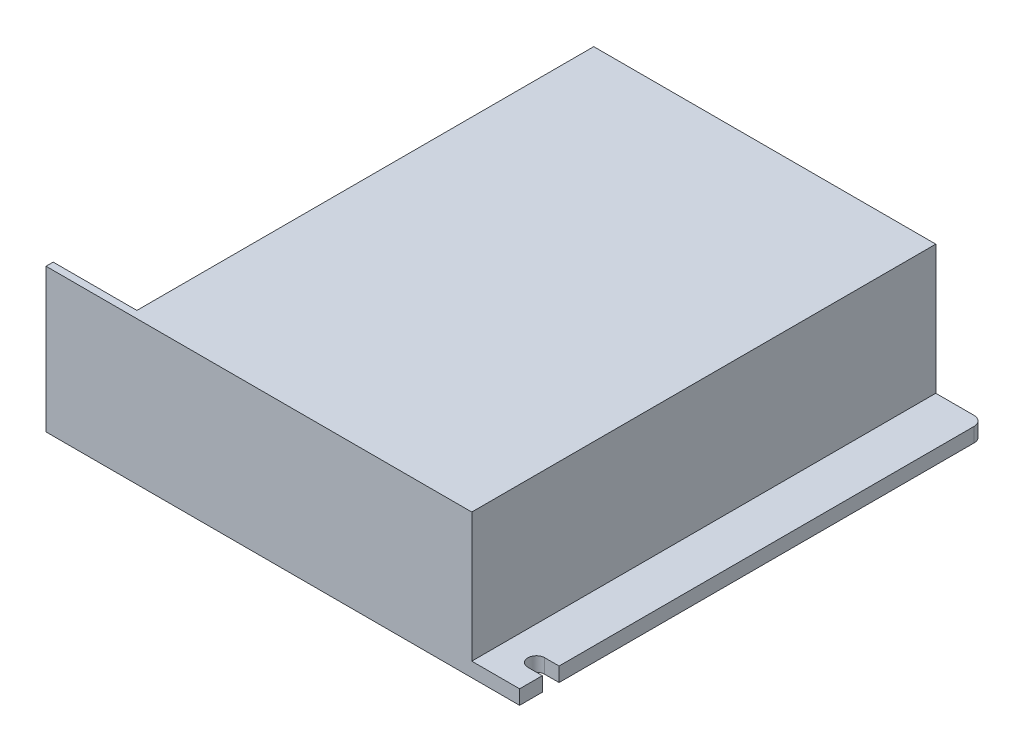
ISO-10303-21;
HEADER;
FILE_DESCRIPTION(('STEP AP214'),'2;1');
FILE_NAME('part.step','',(''),(''),'','','');
FILE_SCHEMA(('AUTOMOTIVE_DESIGN { 1 0 10303 214 1 1 1 1 }'));
ENDSEC;
DATA;
#1=APPLICATION_CONTEXT('core data for automotive mechanical design processes');
#2=APPLICATION_PROTOCOL_DEFINITION('international standard','automotive_design',2000,#1);
#3=PRODUCT_CONTEXT('',#1,'mechanical');
#4=PRODUCT('Part','Part','',(#3));
#5=PRODUCT_RELATED_PRODUCT_CATEGORY('part','',(#4));
#6=PRODUCT_DEFINITION_FORMATION('','',#4);
#7=PRODUCT_DEFINITION_CONTEXT('part definition',#1,'design');
#8=PRODUCT_DEFINITION('design','',#6,#7);
#9=PRODUCT_DEFINITION_SHAPE('','',#8);
#10=(LENGTH_UNIT() NAMED_UNIT(*) SI_UNIT(.MILLI.,.METRE.));
#11=(NAMED_UNIT(*) PLANE_ANGLE_UNIT() SI_UNIT($,.RADIAN.));
#12=(NAMED_UNIT(*) SI_UNIT($,.STERADIAN.) SOLID_ANGLE_UNIT());
#13=UNCERTAINTY_MEASURE_WITH_UNIT(LENGTH_MEASURE(1.E-05),#10,'distance_accuracy_value','');
#14=(GEOMETRIC_REPRESENTATION_CONTEXT(3) GLOBAL_UNCERTAINTY_ASSIGNED_CONTEXT((#13)) GLOBAL_UNIT_ASSIGNED_CONTEXT((#10,
#11,#12)) REPRESENTATION_CONTEXT('',''));
#15=CARTESIAN_POINT('',(0.,0.,0.));
#16=DIRECTION('',(0.,0.,1.));
#17=DIRECTION('',(1.,0.,0.));
#18=AXIS2_PLACEMENT_3D('',#15,#16,#17);
#19=CARTESIAN_POINT('',(99.,3.,0.));
#20=DIRECTION('',(-1.,0.,0.));
#21=DIRECTION('',(0.,0.,1.));
#22=AXIS2_PLACEMENT_3D('',#19,#20,#21);
#23=PLANE('',#22);
#24=DIRECTION('',(0.,0.,-1.));
#25=VECTOR('',#24,1.);
#26=CARTESIAN_POINT('',(99.,0.,0.));
#27=LINE('',#26,#25);
#28=CARTESIAN_POINT('',(99.,0.,-8.25));
#29=VERTEX_POINT('',#28);
#30=CARTESIAN_POINT('',(99.,0.,-95.));
#31=VERTEX_POINT('',#30);
#32=EDGE_CURVE('E275',#29,#31,#27,.T.);
#33=ORIENTED_EDGE('',*,*,#32,.T.);
#34=DIRECTION('',(0.,-1.,0.));
#35=VECTOR('',#34,1.);
#36=CARTESIAN_POINT('',(99.,3.,-95.));
#37=LINE('',#36,#35);
#38=CARTESIAN_POINT('',(99.,3.,-95.));
#39=VERTEX_POINT('',#38);
#40=EDGE_CURVE('E61',#31,#39,#37,.F.);
#41=ORIENTED_EDGE('',*,*,#40,.T.);
#42=DIRECTION('',(0.,0.,-1.));
#43=VECTOR('',#42,1.);
#44=CARTESIAN_POINT('',(99.,3.,0.));
#45=LINE('',#44,#43);
#46=CARTESIAN_POINT('',(99.,3.,-8.25));
#47=VERTEX_POINT('',#46);
#48=EDGE_CURVE('E260',#47,#39,#45,.T.);
#49=ORIENTED_EDGE('',*,*,#48,.F.);
#50=DIRECTION('',(0.,1.,0.));
#51=VECTOR('',#50,1.);
#52=CARTESIAN_POINT('',(99.,0.,-8.25));
#53=LINE('',#52,#51);
#54=EDGE_CURVE('E194',#29,#47,#53,.T.);
#55=ORIENTED_EDGE('',*,*,#54,.F.);
#56=EDGE_LOOP('',(#33,#41,#49,#55));
#57=FACE_BOUND('',#56,.T.);
#58=ADVANCED_FACE('F39',(#57),#23,.F.);
#59=CARTESIAN_POINT('',(0.,3.,0.));
#60=DIRECTION('',(0.,-1.,0.));
#61=DIRECTION('',(0.,0.,-1.));
#62=AXIS2_PLACEMENT_3D('',#59,#60,#61);
#63=PLANE('',#62);
#64=ORIENTED_EDGE('',*,*,#48,.T.);
#65=CARTESIAN_POINT('',(97.,3.,-95.));
#66=DIRECTION('',(0.,-1.,0.));
#67=DIRECTION('',(0.,0.,-1.));
#68=AXIS2_PLACEMENT_3D('',#65,#66,#67);
#69=CIRCLE('',#68,2.);
#70=CARTESIAN_POINT('',(97.,3.,-97.));
#71=VERTEX_POINT('',#70);
#72=EDGE_CURVE('E304',#39,#71,#69,.F.);
#73=ORIENTED_EDGE('',*,*,#72,.T.);
#74=DIRECTION('',(-1.,0.,0.));
#75=VECTOR('',#74,1.);
#76=CARTESIAN_POINT('',(0.,3.,-97.));
#77=LINE('',#76,#75);
#78=CARTESIAN_POINT('',(89.,3.,-97.));
#79=VERTEX_POINT('',#78);
#80=EDGE_CURVE('E266',#71,#79,#77,.T.);
#81=ORIENTED_EDGE('',*,*,#80,.T.);
#82=DIRECTION('',(0.,0.,-1.));
#83=VECTOR('',#82,1.);
#84=CARTESIAN_POINT('',(89.,3.,-97.));
#85=LINE('',#84,#83);
#86=CARTESIAN_POINT('',(89.,3.,0.));
#87=VERTEX_POINT('',#86);
#88=EDGE_CURVE('E204',#87,#79,#85,.T.);
#89=ORIENTED_EDGE('',*,*,#88,.F.);
#90=DIRECTION('',(1.,0.,0.));
#91=VECTOR('',#90,1.);
#92=CARTESIAN_POINT('',(0.,3.,0.));
#93=LINE('',#92,#91);
#94=CARTESIAN_POINT('',(99.,3.,0.));
#95=VERTEX_POINT('',#94);
#96=EDGE_CURVE('E256',#87,#95,#93,.T.);
#97=ORIENTED_EDGE('',*,*,#96,.T.);
#98=CARTESIAN_POINT('',(99.,3.,-4.75));
#99=VERTEX_POINT('',#98);
#100=EDGE_CURVE('E261',#95,#99,#45,.T.);
#101=ORIENTED_EDGE('',*,*,#100,.T.);
#102=DIRECTION('',(1.,0.,0.));
#103=VECTOR('',#102,1.);
#104=CARTESIAN_POINT('',(99.,3.,-4.75));
#105=LINE('',#104,#103);
#106=CARTESIAN_POINT('',(96.,3.,-4.75));
#107=VERTEX_POINT('',#106);
#108=EDGE_CURVE('E179',#107,#99,#105,.T.);
#109=ORIENTED_EDGE('',*,*,#108,.F.);
#110=CARTESIAN_POINT('',(96.,3.,-6.5));
#111=DIRECTION('',(0.,1.,0.));
#112=DIRECTION('',(0.,0.,-1.));
#113=AXIS2_PLACEMENT_3D('',#110,#111,#112);
#114=CIRCLE('',#113,1.75);
#115=CARTESIAN_POINT('',(96.,3.,-8.25));
#116=VERTEX_POINT('',#115);
#117=EDGE_CURVE('E155',#116,#107,#114,.T.);
#118=ORIENTED_EDGE('',*,*,#117,.F.);
#119=DIRECTION('',(-1.,0.,0.));
#120=VECTOR('',#119,1.);
#121=CARTESIAN_POINT('',(96.,3.,-8.25));
#122=LINE('',#121,#120);
#123=EDGE_CURVE('E175',#47,#116,#122,.T.);
#124=ORIENTED_EDGE('',*,*,#123,.F.);
#125=EDGE_LOOP('',(#64,#73,#81,#89,#97,#101,#109,#118,#124));
#126=FACE_BOUND('',#125,.T.);
#127=ADVANCED_FACE('F350',(#126),#63,.F.);
#128=CARTESIAN_POINT('',(3.5,3.,-91.5));
#129=DIRECTION('',(0.,1.,0.));
#130=DIRECTION('',(0.,0.,1.));
#131=AXIS2_PLACEMENT_3D('',#128,#129,#130);
#132=CIRCLE('',#131,1.75);
#133=CARTESIAN_POINT('',(3.5,3.,-89.75));
#134=VERTEX_POINT('',#133);
#135=EDGE_CURVE('E182',#134,#134,#132,.T.);
#136=ORIENTED_EDGE('',*,*,#135,.F.);
#137=EDGE_LOOP('',(#136));
#138=FACE_BOUND('',#137,.T.);
#139=CARTESIAN_POINT('',(17.5,3.,-97.));
#140=VERTEX_POINT('',#139);
#141=CARTESIAN_POINT('',(2.,3.,-97.));
#142=VERTEX_POINT('',#141);
#143=EDGE_CURVE('E265',#140,#142,#77,.T.);
#144=ORIENTED_EDGE('',*,*,#143,.T.);
#145=CARTESIAN_POINT('',(2.,3.,-95.));
#146=DIRECTION('',(0.,-1.,0.));
#147=DIRECTION('',(0.,0.,-1.));
#148=AXIS2_PLACEMENT_3D('',#145,#146,#147);
#149=CIRCLE('',#148,2.);
#150=CARTESIAN_POINT('',(0.,3.,-95.));
#151=VERTEX_POINT('',#150);
#152=EDGE_CURVE('E11',#142,#151,#149,.F.);
#153=ORIENTED_EDGE('',*,*,#152,.T.);
#154=DIRECTION('',(0.,0.,1.));
#155=VECTOR('',#154,1.);
#156=CARTESIAN_POINT('',(0.,3.,0.));
#157=LINE('',#156,#155);
#158=CARTESIAN_POINT('',(0.,3.,-1.5));
#159=VERTEX_POINT('',#158);
#160=EDGE_CURVE('E253',#151,#159,#157,.T.);
#161=ORIENTED_EDGE('',*,*,#160,.T.);
#162=DIRECTION('',(-1.,0.,0.));
#163=VECTOR('',#162,1.);
#164=CARTESIAN_POINT('',(17.5,3.,-1.5));
#165=LINE('',#164,#163);
#166=CARTESIAN_POINT('',(17.5,3.,-1.5));
#167=VERTEX_POINT('',#166);
#168=EDGE_CURVE('E225',#167,#159,#165,.T.);
#169=ORIENTED_EDGE('',*,*,#168,.F.);
#170=DIRECTION('',(0.,0.,1.));
#171=VECTOR('',#170,1.);
#172=CARTESIAN_POINT('',(17.5,3.,-97.));
#173=LINE('',#172,#171);
#174=EDGE_CURVE('E221',#140,#167,#173,.T.);
#175=ORIENTED_EDGE('',*,*,#174,.F.);
#176=EDGE_LOOP('',(#144,#153,#161,#169,#175));
#177=FACE_BOUND('',#176,.T.);
#178=ADVANCED_FACE('F327',(#138,#177),#63,.F.);
#179=CARTESIAN_POINT('',(0.,3.,0.));
#180=DIRECTION('',(1.,0.,0.));
#181=DIRECTION('',(0.,0.,-1.));
#182=AXIS2_PLACEMENT_3D('',#179,#180,#181);
#183=PLANE('',#182);
#184=ORIENTED_EDGE('',*,*,#160,.F.);
#185=DIRECTION('',(0.,-1.,0.));
#186=VECTOR('',#185,1.);
#187=CARTESIAN_POINT('',(0.,3.,-95.));
#188=LINE('',#187,#186);
#189=CARTESIAN_POINT('',(0.,0.,-95.));
#190=VERTEX_POINT('',#189);
#191=EDGE_CURVE('E48',#151,#190,#188,.T.);
#192=ORIENTED_EDGE('',*,*,#191,.T.);
#193=DIRECTION('',(0.,0.,1.));
#194=VECTOR('',#193,1.);
#195=CARTESIAN_POINT('',(0.,0.,0.));
#196=LINE('',#195,#194);
#197=CARTESIAN_POINT('',(0.,0.,0.));
#198=VERTEX_POINT('',#197);
#199=EDGE_CURVE('E252',#190,#198,#196,.T.);
#200=ORIENTED_EDGE('',*,*,#199,.T.);
#201=DIRECTION('',(0.,-1.,0.));
#202=VECTOR('',#201,1.);
#203=CARTESIAN_POINT('',(0.,3.,0.));
#204=LINE('',#203,#202);
#205=CARTESIAN_POINT('',(0.,30.,0.));
#206=VERTEX_POINT('',#205);
#207=EDGE_CURVE('E285',#206,#198,#204,.T.);
#208=ORIENTED_EDGE('',*,*,#207,.F.);
#209=DIRECTION('',(0.,0.,1.));
#210=VECTOR('',#209,1.);
#211=CARTESIAN_POINT('',(0.,30.,-1.5));
#212=LINE('',#211,#210);
#213=CARTESIAN_POINT('',(0.,30.,-1.5));
#214=VERTEX_POINT('',#213);
#215=EDGE_CURVE('E207',#214,#206,#212,.T.);
#216=ORIENTED_EDGE('',*,*,#215,.F.);
#217=DIRECTION('',(0.,-1.,0.));
#218=VECTOR('',#217,1.);
#219=CARTESIAN_POINT('',(0.,30.,-1.5));
#220=LINE('',#219,#218);
#221=EDGE_CURVE('E244',#214,#159,#220,.T.);
#222=ORIENTED_EDGE('',*,*,#221,.T.);
#223=EDGE_LOOP('',(#184,#192,#200,#208,#216,#222));
#224=FACE_BOUND('',#223,.T.);
#225=ADVANCED_FACE('F311',(#224),#183,.F.);
#226=CARTESIAN_POINT('',(0.,3.,0.));
#227=DIRECTION('',(0.,0.,-1.));
#228=DIRECTION('',(-1.,0.,0.));
#229=AXIS2_PLACEMENT_3D('',#226,#227,#228);
#230=PLANE('',#229);
#231=DIRECTION('',(1.,0.,0.));
#232=VECTOR('',#231,1.);
#233=CARTESIAN_POINT('',(0.,0.,0.));
#234=LINE('',#233,#232);
#235=CARTESIAN_POINT('',(99.,0.,0.));
#236=VERTEX_POINT('',#235);
#237=EDGE_CURVE('E272',#198,#236,#234,.T.);
#238=ORIENTED_EDGE('',*,*,#237,.T.);
#239=DIRECTION('',(0.,-1.,0.));
#240=VECTOR('',#239,1.);
#241=CARTESIAN_POINT('',(99.,3.,0.));
#242=LINE('',#241,#240);
#243=EDGE_CURVE('E269',#95,#236,#242,.T.);
#244=ORIENTED_EDGE('',*,*,#243,.F.);
#245=ORIENTED_EDGE('',*,*,#96,.F.);
#246=DIRECTION('',(0.,-1.,0.));
#247=VECTOR('',#246,1.);
#248=CARTESIAN_POINT('',(89.,30.,0.));
#249=LINE('',#248,#247);
#250=CARTESIAN_POINT('',(89.,30.,0.));
#251=VERTEX_POINT('',#250);
#252=EDGE_CURVE('E240',#251,#87,#249,.T.);
#253=ORIENTED_EDGE('',*,*,#252,.F.);
#254=DIRECTION('',(1.,0.,0.));
#255=VECTOR('',#254,1.);
#256=CARTESIAN_POINT('',(0.,30.,0.));
#257=LINE('',#256,#255);
#258=EDGE_CURVE('E211',#206,#251,#257,.T.);
#259=ORIENTED_EDGE('',*,*,#258,.F.);
#260=ORIENTED_EDGE('',*,*,#207,.T.);
#261=EDGE_LOOP('',(#238,#244,#245,#253,#259,#260));
#262=FACE_BOUND('',#261,.T.);
#263=ADVANCED_FACE('F317',(#262),#230,.F.);
#264=CARTESIAN_POINT('',(99.,0.,-4.75));
#265=VERTEX_POINT('',#264);
#266=EDGE_CURVE('E276',#236,#265,#27,.T.);
#267=ORIENTED_EDGE('',*,*,#266,.T.);
#268=DIRECTION('',(0.,1.,0.));
#269=VECTOR('',#268,1.);
#270=CARTESIAN_POINT('',(99.,0.,-4.75));
#271=LINE('',#270,#269);
#272=EDGE_CURVE('E159',#265,#99,#271,.T.);
#273=ORIENTED_EDGE('',*,*,#272,.T.);
#274=ORIENTED_EDGE('',*,*,#100,.F.);
#275=ORIENTED_EDGE('',*,*,#243,.T.);
#276=EDGE_LOOP('',(#267,#273,#274,#275));
#277=FACE_BOUND('',#276,.T.);
#278=ADVANCED_FACE('F352',(#277),#23,.F.);
#279=CARTESIAN_POINT('',(0.,3.,-97.));
#280=DIRECTION('',(0.,0.,1.));
#281=DIRECTION('',(1.,0.,0.));
#282=AXIS2_PLACEMENT_3D('',#279,#280,#281);
#283=PLANE('',#282);
#284=ORIENTED_EDGE('',*,*,#80,.F.);
#285=DIRECTION('',(0.,-1.,0.));
#286=VECTOR('',#285,1.);
#287=CARTESIAN_POINT('',(97.,3.,-97.));
#288=LINE('',#287,#286);
#289=CARTESIAN_POINT('',(97.,0.,-97.));
#290=VERTEX_POINT('',#289);
#291=EDGE_CURVE('E292',#71,#290,#288,.T.);
#292=ORIENTED_EDGE('',*,*,#291,.T.);
#293=DIRECTION('',(-1.,0.,0.));
#294=VECTOR('',#293,1.);
#295=CARTESIAN_POINT('',(0.,0.,-97.));
#296=LINE('',#295,#294);
#297=CARTESIAN_POINT('',(2.,0.,-97.));
#298=VERTEX_POINT('',#297);
#299=EDGE_CURVE('E257',#290,#298,#296,.T.);
#300=ORIENTED_EDGE('',*,*,#299,.T.);
#301=DIRECTION('',(0.,-1.,0.));
#302=VECTOR('',#301,1.);
#303=CARTESIAN_POINT('',(2.,3.,-97.));
#304=LINE('',#303,#302);
#305=EDGE_CURVE('E289',#298,#142,#304,.F.);
#306=ORIENTED_EDGE('',*,*,#305,.T.);
#307=ORIENTED_EDGE('',*,*,#143,.F.);
#308=DIRECTION('',(0.,-1.,0.));
#309=VECTOR('',#308,1.);
#310=CARTESIAN_POINT('',(17.5,30.,-97.));
#311=LINE('',#310,#309);
#312=CARTESIAN_POINT('',(17.5,30.,-97.));
#313=VERTEX_POINT('',#312);
#314=EDGE_CURVE('E220',#313,#140,#311,.T.);
#315=ORIENTED_EDGE('',*,*,#314,.F.);
#316=DIRECTION('',(-1.,0.,0.));
#317=VECTOR('',#316,1.);
#318=CARTESIAN_POINT('',(17.5,30.,-97.));
#319=LINE('',#318,#317);
#320=CARTESIAN_POINT('',(89.,30.,-97.));
#321=VERTEX_POINT('',#320);
#322=EDGE_CURVE('E217',#321,#313,#319,.T.);
#323=ORIENTED_EDGE('',*,*,#322,.F.);
#324=DIRECTION('',(0.,-1.,0.));
#325=VECTOR('',#324,1.);
#326=CARTESIAN_POINT('',(89.,30.,-97.));
#327=LINE('',#326,#325);
#328=EDGE_CURVE('E236',#321,#79,#327,.T.);
#329=ORIENTED_EDGE('',*,*,#328,.T.);
#330=EDGE_LOOP('',(#284,#292,#300,#306,#307,#315,#323,#329));
#331=FACE_BOUND('',#330,.T.);
#332=ADVANCED_FACE('F333',(#331),#283,.F.);
#333=CARTESIAN_POINT('',(0.,0.,0.));
#334=DIRECTION('',(0.,-1.,0.));
#335=DIRECTION('',(0.,0.,-1.));
#336=AXIS2_PLACEMENT_3D('',#333,#334,#335);
#337=PLANE('',#336);
#338=CARTESIAN_POINT('',(3.5,0.,-91.5));
#339=DIRECTION('',(0.,1.,0.));
#340=DIRECTION('',(0.,0.,1.));
#341=AXIS2_PLACEMENT_3D('',#338,#339,#340);
#342=CIRCLE('',#341,1.75);
#343=CARTESIAN_POINT('',(3.5,0.,-89.75));
#344=VERTEX_POINT('',#343);
#345=EDGE_CURVE('E226',#344,#344,#342,.T.);
#346=ORIENTED_EDGE('',*,*,#345,.T.);
#347=EDGE_LOOP('',(#346));
#348=FACE_BOUND('',#347,.T.);
#349=ORIENTED_EDGE('',*,*,#299,.F.);
#350=CARTESIAN_POINT('',(97.,0.,-95.));
#351=DIRECTION('',(0.,-1.,0.));
#352=DIRECTION('',(0.,0.,-1.));
#353=AXIS2_PLACEMENT_3D('',#350,#351,#352);
#354=CIRCLE('',#353,2.);
#355=EDGE_CURVE('E299',#290,#31,#354,.T.);
#356=ORIENTED_EDGE('',*,*,#355,.T.);
#357=ORIENTED_EDGE('',*,*,#32,.F.);
#358=DIRECTION('',(-1.,0.,0.));
#359=VECTOR('',#358,1.);
#360=CARTESIAN_POINT('',(96.,0.,-8.25));
#361=LINE('',#360,#359);
#362=CARTESIAN_POINT('',(96.,0.,-8.25));
#363=VERTEX_POINT('',#362);
#364=EDGE_CURVE('E160',#29,#363,#361,.T.);
#365=ORIENTED_EDGE('',*,*,#364,.T.);
#366=CARTESIAN_POINT('',(96.,0.,-6.5));
#367=DIRECTION('',(0.,1.,0.));
#368=DIRECTION('',(0.,0.,-1.));
#369=AXIS2_PLACEMENT_3D('',#366,#367,#368);
#370=CIRCLE('',#369,1.75);
#371=CARTESIAN_POINT('',(96.,0.,-4.75));
#372=VERTEX_POINT('',#371);
#373=EDGE_CURVE('E152',#363,#372,#370,.T.);
#374=ORIENTED_EDGE('',*,*,#373,.T.);
#375=DIRECTION('',(1.,0.,0.));
#376=VECTOR('',#375,1.);
#377=CARTESIAN_POINT('',(99.,0.,-4.75));
#378=LINE('',#377,#376);
#379=EDGE_CURVE('E163',#372,#265,#378,.T.);
#380=ORIENTED_EDGE('',*,*,#379,.T.);
#381=ORIENTED_EDGE('',*,*,#266,.F.);
#382=ORIENTED_EDGE('',*,*,#237,.F.);
#383=ORIENTED_EDGE('',*,*,#199,.F.);
#384=CARTESIAN_POINT('',(2.,0.,-95.));
#385=DIRECTION('',(0.,-1.,0.));
#386=DIRECTION('',(0.,0.,-1.));
#387=AXIS2_PLACEMENT_3D('',#384,#385,#386);
#388=CIRCLE('',#387,2.);
#389=EDGE_CURVE('E296',#190,#298,#388,.T.);
#390=ORIENTED_EDGE('',*,*,#389,.T.);
#391=EDGE_LOOP('',(#349,#356,#357,#365,#374,#380,#381,#382,#383,#390));
#392=FACE_BOUND('',#391,.T.);
#393=ADVANCED_FACE('F172',(#348,#392),#337,.T.);
#394=CARTESIAN_POINT('',(17.5,30.,-97.));
#395=DIRECTION('',(1.,0.,0.));
#396=DIRECTION('',(0.,0.,-1.));
#397=AXIS2_PLACEMENT_3D('',#394,#395,#396);
#398=PLANE('',#397);
#399=ORIENTED_EDGE('',*,*,#174,.T.);
#400=DIRECTION('',(0.,-1.,0.));
#401=VECTOR('',#400,1.);
#402=CARTESIAN_POINT('',(17.5,30.,-1.5));
#403=LINE('',#402,#401);
#404=CARTESIAN_POINT('',(17.5,30.,-1.5));
#405=VERTEX_POINT('',#404);
#406=EDGE_CURVE('E248',#405,#167,#403,.T.);
#407=ORIENTED_EDGE('',*,*,#406,.F.);
#408=DIRECTION('',(0.,0.,1.));
#409=VECTOR('',#408,1.);
#410=CARTESIAN_POINT('',(17.5,30.,-97.));
#411=LINE('',#410,#409);
#412=EDGE_CURVE('E199',#313,#405,#411,.T.);
#413=ORIENTED_EDGE('',*,*,#412,.F.);
#414=ORIENTED_EDGE('',*,*,#314,.T.);
#415=EDGE_LOOP('',(#399,#407,#413,#414));
#416=FACE_BOUND('',#415,.T.);
#417=ADVANCED_FACE('F337',(#416),#398,.F.);
#418=CARTESIAN_POINT('',(17.5,30.,-1.5));
#419=DIRECTION('',(0.,0.,1.));
#420=DIRECTION('',(1.,0.,0.));
#421=AXIS2_PLACEMENT_3D('',#418,#419,#420);
#422=PLANE('',#421);
#423=ORIENTED_EDGE('',*,*,#168,.T.);
#424=ORIENTED_EDGE('',*,*,#221,.F.);
#425=DIRECTION('',(-1.,0.,0.));
#426=VECTOR('',#425,1.);
#427=CARTESIAN_POINT('',(17.5,30.,-1.5));
#428=LINE('',#427,#426);
#429=EDGE_CURVE('E203',#405,#214,#428,.T.);
#430=ORIENTED_EDGE('',*,*,#429,.F.);
#431=ORIENTED_EDGE('',*,*,#406,.T.);
#432=EDGE_LOOP('',(#423,#424,#430,#431));
#433=FACE_BOUND('',#432,.T.);
#434=ADVANCED_FACE('F326',(#433),#422,.F.);
#435=CARTESIAN_POINT('',(89.,30.,-97.));
#436=DIRECTION('',(-1.,0.,0.));
#437=DIRECTION('',(0.,0.,1.));
#438=AXIS2_PLACEMENT_3D('',#435,#436,#437);
#439=PLANE('',#438);
#440=ORIENTED_EDGE('',*,*,#88,.T.);
#441=ORIENTED_EDGE('',*,*,#328,.F.);
#442=DIRECTION('',(0.,0.,-1.));
#443=VECTOR('',#442,1.);
#444=CARTESIAN_POINT('',(89.,30.,-97.));
#445=LINE('',#444,#443);
#446=EDGE_CURVE('E214',#251,#321,#445,.T.);
#447=ORIENTED_EDGE('',*,*,#446,.F.);
#448=ORIENTED_EDGE('',*,*,#252,.T.);
#449=EDGE_LOOP('',(#440,#441,#447,#448));
#450=FACE_BOUND('',#449,.T.);
#451=ADVANCED_FACE('F344',(#450),#439,.F.);
#452=CARTESIAN_POINT('',(0.,30.,0.));
#453=DIRECTION('',(0.,-1.,0.));
#454=DIRECTION('',(0.,0.,-1.));
#455=AXIS2_PLACEMENT_3D('',#452,#453,#454);
#456=PLANE('',#455);
#457=ORIENTED_EDGE('',*,*,#412,.T.);
#458=ORIENTED_EDGE('',*,*,#429,.T.);
#459=ORIENTED_EDGE('',*,*,#215,.T.);
#460=ORIENTED_EDGE('',*,*,#258,.T.);
#461=ORIENTED_EDGE('',*,*,#446,.T.);
#462=ORIENTED_EDGE('',*,*,#322,.T.);
#463=EDGE_LOOP('',(#457,#458,#459,#460,#461,#462));
#464=FACE_BOUND('',#463,.T.);
#465=ADVANCED_FACE('F321',(#464),#456,.F.);
#466=CARTESIAN_POINT('',(96.,0.,-6.5));
#467=DIRECTION('',(0.,1.,0.));
#468=DIRECTION('',(0.,0.,1.));
#469=AXIS2_PLACEMENT_3D('',#466,#467,#468);
#470=CYLINDRICAL_SURFACE('',#469,1.75);
#471=ORIENTED_EDGE('',*,*,#117,.T.);
#472=DIRECTION('',(0.,1.,0.));
#473=VECTOR('',#472,1.);
#474=CARTESIAN_POINT('',(96.,0.,-4.75));
#475=LINE('',#474,#473);
#476=EDGE_CURVE('E148',#372,#107,#475,.T.);
#477=ORIENTED_EDGE('',*,*,#476,.F.);
#478=ORIENTED_EDGE('',*,*,#373,.F.);
#479=DIRECTION('',(0.,1.,0.));
#480=VECTOR('',#479,1.);
#481=CARTESIAN_POINT('',(96.,0.,-8.25));
#482=LINE('',#481,#480);
#483=EDGE_CURVE('E191',#363,#116,#482,.T.);
#484=ORIENTED_EDGE('',*,*,#483,.T.);
#485=EDGE_LOOP('',(#471,#477,#478,#484));
#486=FACE_BOUND('',#485,.T.);
#487=ADVANCED_FACE('F150',(#486),#470,.F.);
#488=CARTESIAN_POINT('',(96.,0.,-8.25));
#489=DIRECTION('',(0.,0.,-1.));
#490=DIRECTION('',(-1.,0.,0.));
#491=AXIS2_PLACEMENT_3D('',#488,#489,#490);
#492=PLANE('',#491);
#493=ORIENTED_EDGE('',*,*,#123,.T.);
#494=ORIENTED_EDGE('',*,*,#483,.F.);
#495=ORIENTED_EDGE('',*,*,#364,.F.);
#496=ORIENTED_EDGE('',*,*,#54,.T.);
#497=EDGE_LOOP('',(#493,#494,#495,#496));
#498=FACE_BOUND('',#497,.T.);
#499=ADVANCED_FACE('F401',(#498),#492,.F.);
#500=CARTESIAN_POINT('',(99.,0.,-4.75));
#501=DIRECTION('',(0.,0.,1.));
#502=DIRECTION('',(1.,0.,0.));
#503=AXIS2_PLACEMENT_3D('',#500,#501,#502);
#504=PLANE('',#503);
#505=ORIENTED_EDGE('',*,*,#108,.T.);
#506=ORIENTED_EDGE('',*,*,#272,.F.);
#507=ORIENTED_EDGE('',*,*,#379,.F.);
#508=ORIENTED_EDGE('',*,*,#476,.T.);
#509=EDGE_LOOP('',(#505,#506,#507,#508));
#510=FACE_BOUND('',#509,.T.);
#511=ADVANCED_FACE('F164',(#510),#504,.F.);
#512=CARTESIAN_POINT('',(3.5,0.,-91.5));
#513=DIRECTION('',(0.,1.,0.));
#514=DIRECTION('',(0.,0.,1.));
#515=AXIS2_PLACEMENT_3D('',#512,#513,#514);
#516=CYLINDRICAL_SURFACE('',#515,1.75);
#517=ORIENTED_EDGE('',*,*,#345,.F.);
#518=EDGE_LOOP('',(#517));
#519=FACE_BOUND('',#518,.T.);
#520=ORIENTED_EDGE('',*,*,#135,.T.);
#521=EDGE_LOOP('',(#520));
#522=FACE_BOUND('',#521,.T.);
#523=ADVANCED_FACE('F382',(#519,#522),#516,.F.);
#524=CARTESIAN_POINT('',(97.,3.,-95.));
#525=DIRECTION('',(0.,-1.,0.));
#526=DIRECTION('',(0.,0.,-1.));
#527=AXIS2_PLACEMENT_3D('',#524,#525,#526);
#528=CYLINDRICAL_SURFACE('',#527,2.);
#529=ORIENTED_EDGE('',*,*,#72,.F.);
#530=ORIENTED_EDGE('',*,*,#40,.F.);
#531=ORIENTED_EDGE('',*,*,#355,.F.);
#532=ORIENTED_EDGE('',*,*,#291,.F.);
#533=EDGE_LOOP('',(#529,#530,#531,#532));
#534=FACE_BOUND('',#533,.T.);
#535=ADVANCED_FACE('F373',(#534),#528,.T.);
#536=CARTESIAN_POINT('',(2.,3.,-95.));
#537=DIRECTION('',(0.,-1.,0.));
#538=DIRECTION('',(0.,0.,-1.));
#539=AXIS2_PLACEMENT_3D('',#536,#537,#538);
#540=CYLINDRICAL_SURFACE('',#539,2.);
#541=ORIENTED_EDGE('',*,*,#152,.F.);
#542=ORIENTED_EDGE('',*,*,#305,.F.);
#543=ORIENTED_EDGE('',*,*,#389,.F.);
#544=ORIENTED_EDGE('',*,*,#191,.F.);
#545=EDGE_LOOP('',(#541,#542,#543,#544));
#546=FACE_BOUND('',#545,.T.);
#547=ADVANCED_FACE('F41',(#546),#540,.T.);
#548=CLOSED_SHELL('',(#58,#127,#178,#225,#263,#278,#332,#393,#417,#434,#451,#465,#487,#499,#511,
#523,#535,#547));
#549=MANIFOLD_SOLID_BREP('B2',#548);
#550=ADVANCED_BREP_SHAPE_REPRESENTATION('',(#18,#549),#14);
#551=SHAPE_DEFINITION_REPRESENTATION(#9,#550);
ENDSEC;
END-ISO-10303-21;
